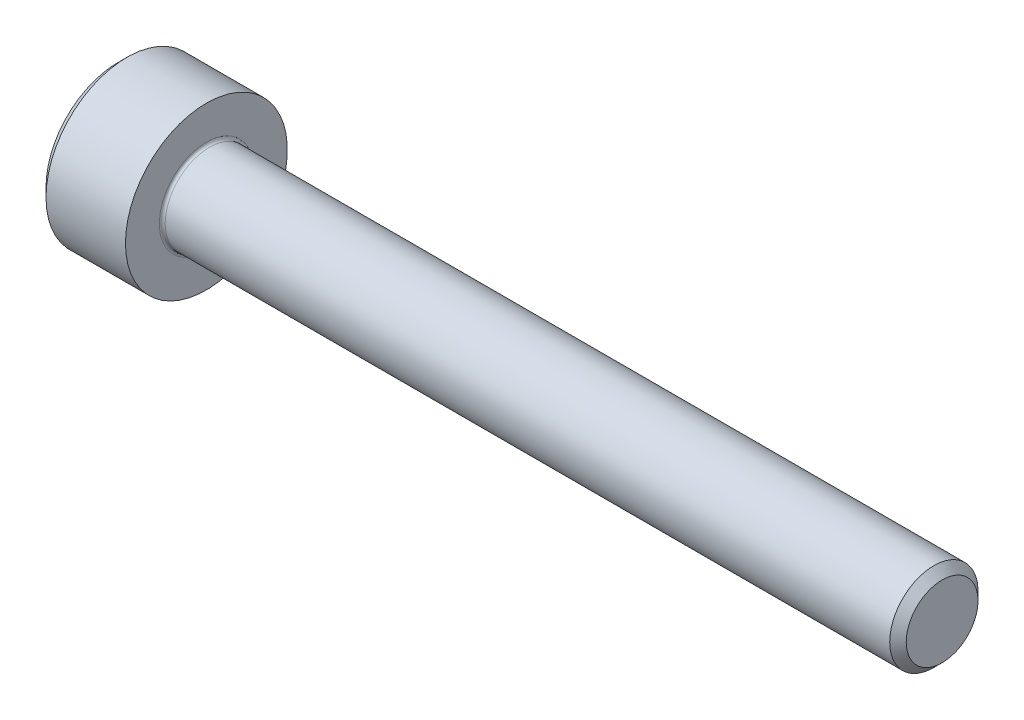
ISO-10303-21;
HEADER;
FILE_DESCRIPTION(('STEP AP214'),'2;1');
FILE_NAME('part.step','',(''),(''),'','','');
FILE_SCHEMA(('AUTOMOTIVE_DESIGN { 1 0 10303 214 1 1 1 1 }'));
ENDSEC;
DATA;
#1=APPLICATION_CONTEXT('core data for automotive mechanical design processes');
#2=APPLICATION_PROTOCOL_DEFINITION('international standard','automotive_design',2000,#1);
#3=PRODUCT_CONTEXT('',#1,'mechanical');
#4=PRODUCT('Part','Part','',(#3));
#5=PRODUCT_RELATED_PRODUCT_CATEGORY('part','',(#4));
#6=PRODUCT_DEFINITION_FORMATION('','',#4);
#7=PRODUCT_DEFINITION_CONTEXT('part definition',#1,'design');
#8=PRODUCT_DEFINITION('design','',#6,#7);
#9=PRODUCT_DEFINITION_SHAPE('','',#8);
#10=(LENGTH_UNIT() NAMED_UNIT(*) SI_UNIT(.MILLI.,.METRE.));
#11=(NAMED_UNIT(*) PLANE_ANGLE_UNIT() SI_UNIT($,.RADIAN.));
#12=(NAMED_UNIT(*) SI_UNIT($,.STERADIAN.) SOLID_ANGLE_UNIT());
#13=UNCERTAINTY_MEASURE_WITH_UNIT(LENGTH_MEASURE(1.E-05),#10,'distance_accuracy_value','');
#14=(GEOMETRIC_REPRESENTATION_CONTEXT(3) GLOBAL_UNCERTAINTY_ASSIGNED_CONTEXT((#13)) GLOBAL_UNIT_ASSIGNED_CONTEXT((#10,
#11,#12)) REPRESENTATION_CONTEXT('',''));
#15=CARTESIAN_POINT('',(0.,0.,0.));
#16=DIRECTION('',(0.,0.,1.));
#17=DIRECTION('',(1.,0.,0.));
#18=AXIS2_PLACEMENT_3D('',#15,#16,#17);
#19=CARTESIAN_POINT('',(0.,0.,0.));
#20=DIRECTION('',(-1.,0.,0.));
#21=DIRECTION('',(0.,0.,1.));
#22=AXIS2_PLACEMENT_3D('',#19,#20,#21);
#23=PLANE('',#22);
#24=DIRECTION('',(0.,-0.5,0.866025403784439));
#25=VECTOR('',#24,1.);
#26=CARTESIAN_POINT('',(0.,1.47801668912544,0.));
#27=LINE('',#26,#25);
#28=CARTESIAN_POINT('',(0.,1.47801668912544,0.));
#29=VERTEX_POINT('',#28);
#30=CARTESIAN_POINT('',(0.,0.739008344562719,1.28));
#31=VERTEX_POINT('',#30);
#32=EDGE_CURVE('E387',#29,#31,#27,.T.);
#33=ORIENTED_EDGE('',*,*,#32,.T.);
#34=DIRECTION('',(0.,1.,0.));
#35=VECTOR('',#34,1.);
#36=CARTESIAN_POINT('',(0.,-0.739008344562723,1.28));
#37=LINE('',#36,#35);
#38=CARTESIAN_POINT('',(0.,-0.739008344562723,1.28));
#39=VERTEX_POINT('',#38);
#40=EDGE_CURVE('E131',#39,#31,#37,.T.);
#41=ORIENTED_EDGE('',*,*,#40,.F.);
#42=DIRECTION('',(0.,-0.500000000000001,-0.866025403784438));
#43=VECTOR('',#42,1.);
#44=CARTESIAN_POINT('',(0.,-0.739008344562723,1.28));
#45=LINE('',#44,#43);
#46=CARTESIAN_POINT('',(0.,-1.47801668912545,0.));
#47=VERTEX_POINT('',#46);
#48=EDGE_CURVE('E390',#39,#47,#45,.T.);
#49=ORIENTED_EDGE('',*,*,#48,.T.);
#50=DIRECTION('',(0.,0.5,-0.866025403784439));
#51=VECTOR('',#50,1.);
#52=CARTESIAN_POINT('',(0.,-1.47801668912545,0.));
#53=LINE('',#52,#51);
#54=CARTESIAN_POINT('',(0.,-0.739008344562726,-1.28));
#55=VERTEX_POINT('',#54);
#56=EDGE_CURVE('E393',#47,#55,#53,.T.);
#57=ORIENTED_EDGE('',*,*,#56,.T.);
#58=DIRECTION('',(0.,-1.,0.));
#59=VECTOR('',#58,1.);
#60=CARTESIAN_POINT('',(0.,0.739008344562717,-1.28));
#61=LINE('',#60,#59);
#62=CARTESIAN_POINT('',(0.,0.739008344562717,-1.28));
#63=VERTEX_POINT('',#62);
#64=EDGE_CURVE('E396',#63,#55,#61,.T.);
#65=ORIENTED_EDGE('',*,*,#64,.F.);
#66=DIRECTION('',(0.,-0.500000000000001,-0.866025403784438));
#67=VECTOR('',#66,1.);
#68=CARTESIAN_POINT('',(0.,1.47801668912544,0.));
#69=LINE('',#68,#67);
#70=EDGE_CURVE('E126',#29,#63,#69,.T.);
#71=ORIENTED_EDGE('',*,*,#70,.F.);
#72=EDGE_LOOP('',(#33,#41,#49,#57,#65,#71));
#73=FACE_BOUND('',#72,.T.);
#74=CARTESIAN_POINT('',(0.,0.,0.));
#75=DIRECTION('',(-1.,0.,0.));
#76=DIRECTION('',(0.,0.,1.));
#77=AXIS2_PLACEMENT_3D('',#74,#75,#76);
#78=CIRCLE('',#77,2.45);
#79=CARTESIAN_POINT('',(0.,0.,2.45));
#80=VERTEX_POINT('',#79);
#81=EDGE_CURVE('E142',#80,#80,#78,.T.);
#82=ORIENTED_EDGE('',*,*,#81,.T.);
#83=EDGE_LOOP('',(#82));
#84=FACE_BOUND('',#83,.T.);
#85=ADVANCED_FACE('F35',(#73,#84),#23,.T.);
#86=CARTESIAN_POINT('',(28.,1.2195,0.));
#87=DIRECTION('',(1.,0.,0.));
#88=DIRECTION('',(0.,0.,-1.));
#89=AXIS2_PLACEMENT_3D('',#86,#87,#88);
#90=PLANE('',#89);
#91=CARTESIAN_POINT('',(28.,0.,0.));
#92=DIRECTION('',(-1.,0.,0.));
#93=DIRECTION('',(0.,0.,1.));
#94=AXIS2_PLACEMENT_3D('',#91,#92,#93);
#95=CIRCLE('',#94,1.2195);
#96=CARTESIAN_POINT('',(28.,0.,1.2195));
#97=VERTEX_POINT('',#96);
#98=EDGE_CURVE('E155',#97,#97,#95,.T.);
#99=ORIENTED_EDGE('',*,*,#98,.F.);
#100=EDGE_LOOP('',(#99));
#101=FACE_BOUND('',#100,.T.);
#102=ADVANCED_FACE('F176',(#101),#90,.T.);
#103=CARTESIAN_POINT('',(28.,0.,0.));
#104=DIRECTION('',(-1.,0.,0.));
#105=DIRECTION('',(0.,0.,1.));
#106=AXIS2_PLACEMENT_3D('',#103,#104,#105);
#107=CONICAL_SURFACE('',#106,1.2195,0.785398163397411);
#108=CARTESIAN_POINT('',(27.7195,0.,0.));
#109=DIRECTION('',(-1.,0.,0.));
#110=DIRECTION('',(0.,0.,1.));
#111=AXIS2_PLACEMENT_3D('',#108,#109,#110);
#112=CIRCLE('',#111,1.49999999999998);
#113=CARTESIAN_POINT('',(27.7195,0.,1.49999999999998));
#114=VERTEX_POINT('',#113);
#115=EDGE_CURVE('E152',#114,#114,#112,.T.);
#116=ORIENTED_EDGE('',*,*,#115,.F.);
#117=EDGE_LOOP('',(#116));
#118=FACE_BOUND('',#117,.T.);
#119=ORIENTED_EDGE('',*,*,#98,.T.);
#120=EDGE_LOOP('',(#119));
#121=FACE_BOUND('',#120,.T.);
#122=ADVANCED_FACE('F182',(#118,#121),#107,.T.);
#123=CARTESIAN_POINT('',(-31.75,0.,0.));
#124=DIRECTION('',(-1.,0.,0.));
#125=DIRECTION('',(0.,0.,1.));
#126=AXIS2_PLACEMENT_3D('',#123,#124,#125);
#127=CYLINDRICAL_SURFACE('',#126,1.49999999999999);
#128=CARTESIAN_POINT('',(3.1,0.,0.));
#129=DIRECTION('',(1.,0.,0.));
#130=DIRECTION('',(0.,0.,-1.));
#131=AXIS2_PLACEMENT_3D('',#128,#129,#130);
#132=CIRCLE('',#131,1.49999999999999);
#133=CARTESIAN_POINT('',(3.1,0.,-1.49999999999999));
#134=VERTEX_POINT('',#133);
#135=EDGE_CURVE('E11',#134,#134,#132,.T.);
#136=ORIENTED_EDGE('',*,*,#135,.T.);
#137=EDGE_LOOP('',(#136));
#138=FACE_BOUND('',#137,.T.);
#139=ORIENTED_EDGE('',*,*,#115,.T.);
#140=EDGE_LOOP('',(#139));
#141=FACE_BOUND('',#140,.T.);
#142=ADVANCED_FACE('F193',(#138,#141),#127,.T.);
#143=CARTESIAN_POINT('',(3.,2.75,0.));
#144=DIRECTION('',(1.,0.,0.));
#145=DIRECTION('',(0.,0.,-1.));
#146=AXIS2_PLACEMENT_3D('',#143,#144,#145);
#147=PLANE('',#146);
#148=CARTESIAN_POINT('',(3.,0.,0.));
#149=DIRECTION('',(1.,0.,0.));
#150=DIRECTION('',(0.,0.,-1.));
#151=AXIS2_PLACEMENT_3D('',#148,#149,#150);
#152=CIRCLE('',#151,1.59999999999999);
#153=CARTESIAN_POINT('',(3.,0.,-1.59999999999999));
#154=VERTEX_POINT('',#153);
#155=EDGE_CURVE('E43',#154,#154,#152,.F.);
#156=ORIENTED_EDGE('',*,*,#155,.T.);
#157=EDGE_LOOP('',(#156));
#158=FACE_BOUND('',#157,.T.);
#159=CARTESIAN_POINT('',(3.,0.,0.));
#160=DIRECTION('',(-1.,0.,0.));
#161=DIRECTION('',(0.,0.,1.));
#162=AXIS2_PLACEMENT_3D('',#159,#160,#161);
#163=CIRCLE('',#162,2.75);
#164=CARTESIAN_POINT('',(3.,0.,2.75));
#165=VERTEX_POINT('',#164);
#166=EDGE_CURVE('E149',#165,#165,#163,.T.);
#167=ORIENTED_EDGE('',*,*,#166,.F.);
#168=EDGE_LOOP('',(#167));
#169=FACE_BOUND('',#168,.T.);
#170=ADVANCED_FACE('F160',(#158,#169),#147,.T.);
#171=CARTESIAN_POINT('',(-31.75,0.,0.));
#172=DIRECTION('',(-1.,0.,0.));
#173=DIRECTION('',(0.,0.,1.));
#174=AXIS2_PLACEMENT_3D('',#171,#172,#173);
#175=CYLINDRICAL_SURFACE('',#174,2.75);
#176=ORIENTED_EDGE('',*,*,#166,.T.);
#177=EDGE_LOOP('',(#176));
#178=FACE_BOUND('',#177,.T.);
#179=CARTESIAN_POINT('',(0.300000000000002,0.,0.));
#180=DIRECTION('',(-1.,0.,0.));
#181=DIRECTION('',(0.,0.,1.));
#182=AXIS2_PLACEMENT_3D('',#179,#180,#181);
#183=CIRCLE('',#182,2.75);
#184=CARTESIAN_POINT('',(0.300000000000002,0.,2.75));
#185=VERTEX_POINT('',#184);
#186=EDGE_CURVE('E146',#185,#185,#183,.T.);
#187=ORIENTED_EDGE('',*,*,#186,.F.);
#188=EDGE_LOOP('',(#187));
#189=FACE_BOUND('',#188,.T.);
#190=ADVANCED_FACE('F171',(#178,#189),#175,.T.);
#191=CARTESIAN_POINT('',(0.,0.,0.));
#192=DIRECTION('',(1.,0.,0.));
#193=DIRECTION('',(0.,0.,-1.));
#194=AXIS2_PLACEMENT_3D('',#191,#192,#193);
#195=CONICAL_SURFACE('',#194,2.45,0.785398163397447);
#196=ORIENTED_EDGE('',*,*,#186,.T.);
#197=EDGE_LOOP('',(#196));
#198=FACE_BOUND('',#197,.T.);
#199=ORIENTED_EDGE('',*,*,#81,.F.);
#200=EDGE_LOOP('',(#199));
#201=FACE_BOUND('',#200,.T.);
#202=ADVANCED_FACE('F164',(#198,#201),#195,.T.);
#203=CARTESIAN_POINT('',(3.1,0.,0.));
#204=DIRECTION('',(1.,0.,0.));
#205=DIRECTION('',(0.,0.,-1.));
#206=AXIS2_PLACEMENT_3D('',#203,#204,#205);
#207=TOROIDAL_SURFACE('',#206,1.59999999999999,0.1);
#208=ORIENTED_EDGE('',*,*,#135,.F.);
#209=EDGE_LOOP('',(#208));
#210=FACE_BOUND('',#209,.T.);
#211=ORIENTED_EDGE('',*,*,#155,.F.);
#212=EDGE_LOOP('',(#211));
#213=FACE_BOUND('',#212,.T.);
#214=ADVANCED_FACE('F37',(#210,#213),#207,.F.);
#215=CARTESIAN_POINT('',(1.3,1.47801668912544,0.));
#216=DIRECTION('',(0.,-0.866025403784439,-0.5));
#217=DIRECTION('',(0.,0.5,-0.866025403784439));
#218=AXIS2_PLACEMENT_3D('',#215,#216,#217);
#219=PLANE('',#218);
#220=ORIENTED_EDGE('',*,*,#32,.F.);
#221=DIRECTION('',(-1.,0.,0.));
#222=VECTOR('',#221,1.);
#223=CARTESIAN_POINT('',(1.3,1.47801668912544,0.));
#224=LINE('',#223,#222);
#225=CARTESIAN_POINT('',(1.3,1.47801668912544,0.));
#226=VERTEX_POINT('',#225);
#227=EDGE_CURVE('E377',#226,#29,#224,.T.);
#228=ORIENTED_EDGE('',*,*,#227,.F.);
#229=DIRECTION('',(0.,-0.5,0.866025403784439));
#230=VECTOR('',#229,1.);
#231=CARTESIAN_POINT('',(1.3,1.47801668912544,0.));
#232=LINE('',#231,#230);
#233=CARTESIAN_POINT('',(1.3,1.10851251684408,0.639999999999998));
#234=VERTEX_POINT('',#233);
#235=EDGE_CURVE('E118',#226,#234,#232,.T.);
#236=ORIENTED_EDGE('',*,*,#235,.T.);
#237=CARTESIAN_POINT('',(1.3,0.739008344562719,1.28));
#238=VERTEX_POINT('',#237);
#239=EDGE_CURVE('E109',#234,#238,#232,.T.);
#240=ORIENTED_EDGE('',*,*,#239,.T.);
#241=DIRECTION('',(-1.,0.,0.));
#242=VECTOR('',#241,1.);
#243=CARTESIAN_POINT('',(1.3,0.739008344562719,1.28));
#244=LINE('',#243,#242);
#245=EDGE_CURVE('E123',#238,#31,#244,.T.);
#246=ORIENTED_EDGE('',*,*,#245,.T.);
#247=EDGE_LOOP('',(#220,#228,#236,#240,#246));
#248=FACE_BOUND('',#247,.T.);
#249=ADVANCED_FACE('F122',(#248),#219,.T.);
#250=CARTESIAN_POINT('',(1.3,-0.739008344562723,1.28));
#251=DIRECTION('',(0.,0.,1.));
#252=DIRECTION('',(0.,-1.,0.));
#253=AXIS2_PLACEMENT_3D('',#250,#251,#252);
#254=PLANE('',#253);
#255=ORIENTED_EDGE('',*,*,#40,.T.);
#256=ORIENTED_EDGE('',*,*,#245,.F.);
#257=DIRECTION('',(0.,1.,0.));
#258=VECTOR('',#257,1.);
#259=CARTESIAN_POINT('',(1.3,-0.739008344562723,1.28));
#260=LINE('',#259,#258);
#261=CARTESIAN_POINT('',(1.3,0.,1.28));
#262=VERTEX_POINT('',#261);
#263=EDGE_CURVE('E106',#262,#238,#260,.T.);
#264=ORIENTED_EDGE('',*,*,#263,.F.);
#265=CARTESIAN_POINT('',(1.3,-0.739008344562723,1.28));
#266=VERTEX_POINT('',#265);
#267=EDGE_CURVE('E117',#266,#262,#260,.T.);
#268=ORIENTED_EDGE('',*,*,#267,.F.);
#269=DIRECTION('',(-1.,0.,0.));
#270=VECTOR('',#269,1.);
#271=CARTESIAN_POINT('',(1.3,-0.739008344562723,1.28));
#272=LINE('',#271,#270);
#273=EDGE_CURVE('E133',#266,#39,#272,.T.);
#274=ORIENTED_EDGE('',*,*,#273,.T.);
#275=EDGE_LOOP('',(#255,#256,#264,#268,#274));
#276=FACE_BOUND('',#275,.T.);
#277=ADVANCED_FACE('F128',(#276),#254,.F.);
#278=CARTESIAN_POINT('',(1.3,-0.739008344562723,1.28));
#279=DIRECTION('',(0.,0.866025403784438,-0.500000000000001));
#280=DIRECTION('',(0.,0.500000000000001,0.866025403784438));
#281=AXIS2_PLACEMENT_3D('',#278,#279,#280);
#282=PLANE('',#281);
#283=ORIENTED_EDGE('',*,*,#48,.F.);
#284=ORIENTED_EDGE('',*,*,#273,.F.);
#285=DIRECTION('',(0.,-0.500000000000001,-0.866025403784438));
#286=VECTOR('',#285,1.);
#287=CARTESIAN_POINT('',(1.3,-0.739008344562723,1.28));
#288=LINE('',#287,#286);
#289=CARTESIAN_POINT('',(1.3,-1.10851251684408,0.640000000000003));
#290=VERTEX_POINT('',#289);
#291=EDGE_CURVE('E416',#266,#290,#288,.T.);
#292=ORIENTED_EDGE('',*,*,#291,.T.);
#293=CARTESIAN_POINT('',(1.3,-1.47801668912545,0.));
#294=VERTEX_POINT('',#293);
#295=EDGE_CURVE('E405',#290,#294,#288,.T.);
#296=ORIENTED_EDGE('',*,*,#295,.T.);
#297=DIRECTION('',(-1.,0.,0.));
#298=VECTOR('',#297,1.);
#299=CARTESIAN_POINT('',(1.3,-1.47801668912545,0.));
#300=LINE('',#299,#298);
#301=EDGE_CURVE('E138',#294,#47,#300,.T.);
#302=ORIENTED_EDGE('',*,*,#301,.T.);
#303=EDGE_LOOP('',(#283,#284,#292,#296,#302));
#304=FACE_BOUND('',#303,.T.);
#305=ADVANCED_FACE('F268',(#304),#282,.T.);
#306=CARTESIAN_POINT('',(1.3,-1.47801668912545,0.));
#307=DIRECTION('',(0.,0.866025403784439,0.5));
#308=DIRECTION('',(0.,-0.5,0.866025403784439));
#309=AXIS2_PLACEMENT_3D('',#306,#307,#308);
#310=PLANE('',#309);
#311=ORIENTED_EDGE('',*,*,#56,.F.);
#312=ORIENTED_EDGE('',*,*,#301,.F.);
#313=DIRECTION('',(0.,0.5,-0.866025403784439));
#314=VECTOR('',#313,1.);
#315=CARTESIAN_POINT('',(1.3,-1.47801668912545,0.));
#316=LINE('',#315,#314);
#317=CARTESIAN_POINT('',(1.3,-1.10851251684409,-0.640000000000002));
#318=VERTEX_POINT('',#317);
#319=EDGE_CURVE('E383',#294,#318,#316,.T.);
#320=ORIENTED_EDGE('',*,*,#319,.T.);
#321=CARTESIAN_POINT('',(1.3,-0.739008344562726,-1.28));
#322=VERTEX_POINT('',#321);
#323=EDGE_CURVE('E415',#318,#322,#316,.T.);
#324=ORIENTED_EDGE('',*,*,#323,.T.);
#325=DIRECTION('',(-1.,0.,0.));
#326=VECTOR('',#325,1.);
#327=CARTESIAN_POINT('',(1.3,-0.739008344562726,-1.28));
#328=LINE('',#327,#326);
#329=EDGE_CURVE('E376',#322,#55,#328,.T.);
#330=ORIENTED_EDGE('',*,*,#329,.T.);
#331=EDGE_LOOP('',(#311,#312,#320,#324,#330));
#332=FACE_BOUND('',#331,.T.);
#333=ADVANCED_FACE('F276',(#332),#310,.T.);
#334=CARTESIAN_POINT('',(1.3,0.739008344562717,-1.28));
#335=DIRECTION('',(0.,0.,-1.));
#336=DIRECTION('',(0.,1.,0.));
#337=AXIS2_PLACEMENT_3D('',#334,#335,#336);
#338=PLANE('',#337);
#339=ORIENTED_EDGE('',*,*,#64,.T.);
#340=ORIENTED_EDGE('',*,*,#329,.F.);
#341=DIRECTION('',(0.,-1.,0.));
#342=VECTOR('',#341,1.);
#343=CARTESIAN_POINT('',(1.3,0.739008344562717,-1.28));
#344=LINE('',#343,#342);
#345=CARTESIAN_POINT('',(1.3,0.,-1.28));
#346=VERTEX_POINT('',#345);
#347=EDGE_CURVE('E380',#346,#322,#344,.T.);
#348=ORIENTED_EDGE('',*,*,#347,.F.);
#349=CARTESIAN_POINT('',(1.3,0.739008344562717,-1.28));
#350=VERTEX_POINT('',#349);
#351=EDGE_CURVE('E50',#350,#346,#344,.T.);
#352=ORIENTED_EDGE('',*,*,#351,.F.);
#353=DIRECTION('',(-1.,0.,0.));
#354=VECTOR('',#353,1.);
#355=CARTESIAN_POINT('',(1.3,0.739008344562717,-1.28));
#356=LINE('',#355,#354);
#357=EDGE_CURVE('E373',#350,#63,#356,.T.);
#358=ORIENTED_EDGE('',*,*,#357,.T.);
#359=EDGE_LOOP('',(#339,#340,#348,#352,#358));
#360=FACE_BOUND('',#359,.T.);
#361=ADVANCED_FACE('F285',(#360),#338,.F.);
#362=CARTESIAN_POINT('',(1.3,1.47801668912544,0.));
#363=DIRECTION('',(0.,0.866025403784438,-0.500000000000001));
#364=DIRECTION('',(0.,0.500000000000001,0.866025403784438));
#365=AXIS2_PLACEMENT_3D('',#362,#363,#364);
#366=PLANE('',#365);
#367=ORIENTED_EDGE('',*,*,#70,.T.);
#368=ORIENTED_EDGE('',*,*,#357,.F.);
#369=DIRECTION('',(0.,-0.500000000000001,-0.866025403784438));
#370=VECTOR('',#369,1.);
#371=CARTESIAN_POINT('',(1.3,1.47801668912544,0.));
#372=LINE('',#371,#370);
#373=CARTESIAN_POINT('',(1.3,1.10851251684408,-0.640000000000002));
#374=VERTEX_POINT('',#373);
#375=EDGE_CURVE('E363',#374,#350,#372,.T.);
#376=ORIENTED_EDGE('',*,*,#375,.F.);
#377=EDGE_CURVE('E369',#226,#374,#372,.T.);
#378=ORIENTED_EDGE('',*,*,#377,.F.);
#379=ORIENTED_EDGE('',*,*,#227,.T.);
#380=EDGE_LOOP('',(#367,#368,#376,#378,#379));
#381=FACE_BOUND('',#380,.T.);
#382=ADVANCED_FACE('F294',(#381),#366,.F.);
#383=CARTESIAN_POINT('',(1.3,1.47801668912544,0.));
#384=DIRECTION('',(1.,0.,0.));
#385=DIRECTION('',(0.,0.,-1.));
#386=AXIS2_PLACEMENT_3D('',#383,#384,#385);
#387=PLANE('',#386);
#388=ORIENTED_EDGE('',*,*,#347,.T.);
#389=ORIENTED_EDGE('',*,*,#323,.F.);
#390=CARTESIAN_POINT('',(1.3,0.,0.));
#391=DIRECTION('',(-1.,0.,0.));
#392=DIRECTION('',(0.,0.,1.));
#393=AXIS2_PLACEMENT_3D('',#390,#391,#392);
#394=CIRCLE('',#393,1.28);
#395=EDGE_CURVE('E411',#346,#318,#394,.T.);
#396=ORIENTED_EDGE('',*,*,#395,.F.);
#397=EDGE_LOOP('',(#388,#389,#396));
#398=FACE_BOUND('',#397,.T.);
#399=ADVANCED_FACE('F303',(#398),#387,.F.);
#400=ORIENTED_EDGE('',*,*,#319,.F.);
#401=ORIENTED_EDGE('',*,*,#295,.F.);
#402=EDGE_CURVE('E136',#318,#290,#394,.T.);
#403=ORIENTED_EDGE('',*,*,#402,.F.);
#404=EDGE_LOOP('',(#400,#401,#403));
#405=FACE_BOUND('',#404,.T.);
#406=ADVANCED_FACE('F312',(#405),#387,.F.);
#407=ORIENTED_EDGE('',*,*,#291,.F.);
#408=ORIENTED_EDGE('',*,*,#267,.T.);
#409=EDGE_CURVE('E132',#290,#262,#394,.T.);
#410=ORIENTED_EDGE('',*,*,#409,.F.);
#411=EDGE_LOOP('',(#407,#408,#410));
#412=FACE_BOUND('',#411,.T.);
#413=ADVANCED_FACE('F321',(#412),#387,.F.);
#414=ORIENTED_EDGE('',*,*,#263,.T.);
#415=ORIENTED_EDGE('',*,*,#239,.F.);
#416=EDGE_CURVE('E112',#262,#234,#394,.T.);
#417=ORIENTED_EDGE('',*,*,#416,.F.);
#418=EDGE_LOOP('',(#414,#415,#417));
#419=FACE_BOUND('',#418,.T.);
#420=ADVANCED_FACE('F108',(#419),#387,.F.);
#421=ORIENTED_EDGE('',*,*,#235,.F.);
#422=ORIENTED_EDGE('',*,*,#377,.T.);
#423=EDGE_CURVE('E143',#234,#374,#394,.T.);
#424=ORIENTED_EDGE('',*,*,#423,.F.);
#425=EDGE_LOOP('',(#421,#422,#424));
#426=FACE_BOUND('',#425,.T.);
#427=ADVANCED_FACE('F336',(#426),#387,.F.);
#428=ORIENTED_EDGE('',*,*,#375,.T.);
#429=ORIENTED_EDGE('',*,*,#351,.T.);
#430=EDGE_CURVE('E366',#374,#346,#394,.T.);
#431=ORIENTED_EDGE('',*,*,#430,.F.);
#432=EDGE_LOOP('',(#428,#429,#431));
#433=FACE_BOUND('',#432,.T.);
#434=ADVANCED_FACE('F251',(#433),#387,.F.);
#435=CARTESIAN_POINT('',(1.3,0.,0.));
#436=DIRECTION('',(-1.,0.,0.));
#437=DIRECTION('',(0.,0.,1.));
#438=AXIS2_PLACEMENT_3D('',#435,#436,#437);
#439=CONICAL_SURFACE('',#438,1.28,1.0471975511966);
#440=CARTESIAN_POINT('',(2.03900834456273,0.,0.));
#441=VERTEX_POINT('',#440);
#442=VERTEX_LOOP('',#441);
#443=FACE_BOUND('',#442,.T.);
#444=ORIENTED_EDGE('',*,*,#416,.T.);
#445=ORIENTED_EDGE('',*,*,#423,.T.);
#446=ORIENTED_EDGE('',*,*,#430,.T.);
#447=ORIENTED_EDGE('',*,*,#395,.T.);
#448=ORIENTED_EDGE('',*,*,#402,.T.);
#449=ORIENTED_EDGE('',*,*,#409,.T.);
#450=EDGE_LOOP('',(#444,#445,#446,#447,#448,#449));
#451=FACE_BOUND('',#450,.T.);
#452=ADVANCED_FACE('F186',(#443,#451),#439,.F.);
#453=CLOSED_SHELL('',(#85,#102,#122,#142,#170,#190,#202,#214,#249,#277,#305,#333,#361,#382,#399,
#406,#413,#420,#427,#434,#452));
#454=MANIFOLD_SOLID_BREP('B2',#453);
#455=ADVANCED_BREP_SHAPE_REPRESENTATION('',(#18,#454),#14);
#456=SHAPE_DEFINITION_REPRESENTATION(#9,#455);
ENDSEC;
END-ISO-10303-21;
